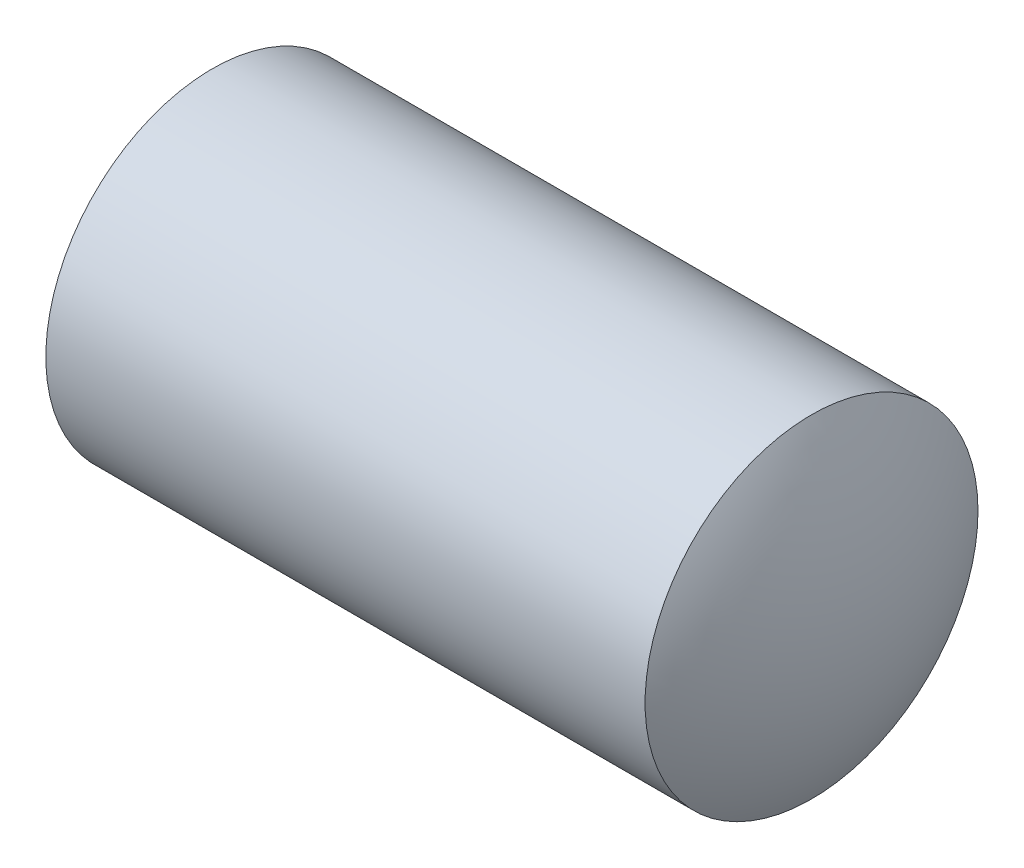
ISO-10303-21;
HEADER;
FILE_DESCRIPTION(('STEP AP214'),'2;1');
FILE_NAME('part.step','',(''),(''),'','','');
FILE_SCHEMA(('AUTOMOTIVE_DESIGN { 1 0 10303 214 1 1 1 1 }'));
ENDSEC;
DATA;
#1=APPLICATION_CONTEXT('core data for automotive mechanical design processes');
#2=APPLICATION_PROTOCOL_DEFINITION('international standard','automotive_design',2000,#1);
#3=PRODUCT_CONTEXT('',#1,'mechanical');
#4=PRODUCT('Part','Part','',(#3));
#5=PRODUCT_RELATED_PRODUCT_CATEGORY('part','',(#4));
#6=PRODUCT_DEFINITION_FORMATION('','',#4);
#7=PRODUCT_DEFINITION_CONTEXT('part definition',#1,'design');
#8=PRODUCT_DEFINITION('design','',#6,#7);
#9=PRODUCT_DEFINITION_SHAPE('','',#8);
#10=(LENGTH_UNIT() NAMED_UNIT(*) SI_UNIT(.MILLI.,.METRE.));
#11=(NAMED_UNIT(*) PLANE_ANGLE_UNIT() SI_UNIT($,.RADIAN.));
#12=(NAMED_UNIT(*) SI_UNIT($,.STERADIAN.) SOLID_ANGLE_UNIT());
#13=UNCERTAINTY_MEASURE_WITH_UNIT(LENGTH_MEASURE(1.E-05),#10,'distance_accuracy_value','');
#14=(GEOMETRIC_REPRESENTATION_CONTEXT(3) GLOBAL_UNCERTAINTY_ASSIGNED_CONTEXT((#13)) GLOBAL_UNIT_ASSIGNED_CONTEXT((#10,
#11,#12)) REPRESENTATION_CONTEXT('',''));
#15=CARTESIAN_POINT('',(0.,0.,0.));
#16=DIRECTION('',(0.,0.,1.));
#17=DIRECTION('',(1.,0.,0.));
#18=AXIS2_PLACEMENT_3D('',#15,#16,#17);
#19=CARTESIAN_POINT('',(-27.6019237886467,0.,0.9));
#20=DIRECTION('',(0.,1.,0.));
#21=DIRECTION('',(-1.,0.,0.));
#22=AXIS2_PLACEMENT_3D('',#19,#20,#21);
#23=SPHERICAL_SURFACE('',#22,3.);
#24=CARTESIAN_POINT('',(-27.6019237886467,0.,0.9));
#25=DIRECTION('',(1.,0.,0.));
#26=DIRECTION('',(0.,0.,-1.));
#27=AXIS2_PLACEMENT_3D('',#24,#25,#26);
#28=SPHERICAL_SURFACE('',#27,3.);
#29=CARTESIAN_POINT('',(-30.2,0.,0.9));
#30=DIRECTION('',(1.,0.,0.));
#31=DIRECTION('',(0.,0.,-1.));
#32=AXIS2_PLACEMENT_3D('',#29,#30,#31);
#33=CIRCLE('',#32,1.5);
#34=CARTESIAN_POINT('',(-30.2,0.,-0.6));
#35=VERTEX_POINT('',#34);
#36=EDGE_CURVE('E11',#35,#35,#33,.T.);
#37=ORIENTED_EDGE('',*,*,#36,.F.);
#38=EDGE_LOOP('',(#37));
#39=FACE_BOUND('',#38,.T.);
#40=ADVANCED_FACE('F17',(#39),#28,.T.);
#41=CARTESIAN_POINT('',(-27.3980762113533,0.,0.9));
#42=DIRECTION('',(0.,1.,0.));
#43=DIRECTION('',(1.,0.,0.));
#44=AXIS2_PLACEMENT_3D('',#41,#42,#43);
#45=SPHERICAL_SURFACE('',#44,3.);
#46=CARTESIAN_POINT('',(-27.3980762113533,0.,0.9));
#47=DIRECTION('',(1.,0.,0.));
#48=DIRECTION('',(0.,0.,-1.));
#49=AXIS2_PLACEMENT_3D('',#46,#47,#48);
#50=SPHERICAL_SURFACE('',#49,3.);
#51=CARTESIAN_POINT('',(-24.8,0.,0.9));
#52=DIRECTION('',(1.,0.,0.));
#53=DIRECTION('',(0.,0.,-1.));
#54=AXIS2_PLACEMENT_3D('',#51,#52,#53);
#55=CIRCLE('',#54,1.5);
#56=CARTESIAN_POINT('',(-24.8,0.,-0.6));
#57=VERTEX_POINT('',#56);
#58=EDGE_CURVE('E27',#57,#57,#55,.T.);
#59=ORIENTED_EDGE('',*,*,#58,.T.);
#60=EDGE_LOOP('',(#59));
#61=FACE_BOUND('',#60,.T.);
#62=ADVANCED_FACE('F19',(#61),#50,.T.);
#63=CARTESIAN_POINT('',(-26.15,0.,0.9));
#64=DIRECTION('',(1.,0.,0.));
#65=DIRECTION('',(0.,0.,-1.));
#66=AXIS2_PLACEMENT_3D('',#63,#64,#65);
#67=CYLINDRICAL_SURFACE('',#66,1.5);
#68=ORIENTED_EDGE('',*,*,#36,.T.);
#69=EDGE_LOOP('',(#68));
#70=FACE_BOUND('',#69,.T.);
#71=ORIENTED_EDGE('',*,*,#58,.F.);
#72=EDGE_LOOP('',(#71));
#73=FACE_BOUND('',#72,.T.);
#74=ADVANCED_FACE('F57',(#70,#73),#67,.T.);
#75=CLOSED_SHELL('',(#40,#62,#74));
#76=MANIFOLD_SOLID_BREP('B1',#75);
#77=ADVANCED_BREP_SHAPE_REPRESENTATION('',(#18,#76),#14);
#78=SHAPE_DEFINITION_REPRESENTATION(#9,#77);
ENDSEC;
END-ISO-10303-21;
